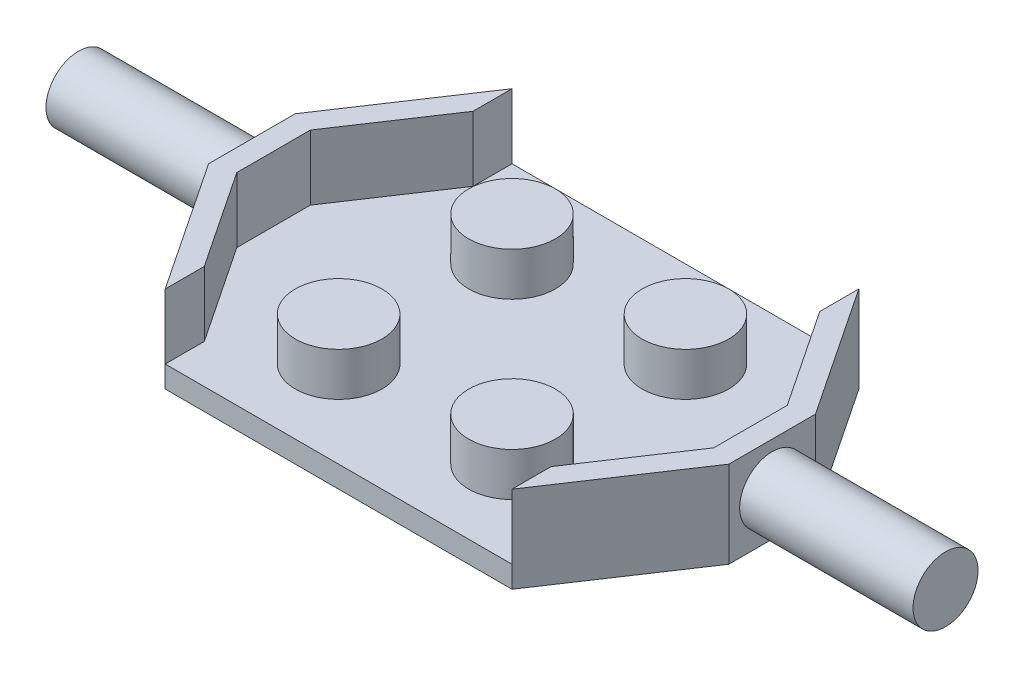
ISO-10303-21;
HEADER;
FILE_DESCRIPTION(('STEP AP214'),'2;1');
FILE_NAME('part.step','',(''),(''),'','','');
FILE_SCHEMA(('AUTOMOTIVE_DESIGN { 1 0 10303 214 1 1 1 1 }'));
ENDSEC;
DATA;
#1=APPLICATION_CONTEXT('core data for automotive mechanical design processes');
#2=APPLICATION_PROTOCOL_DEFINITION('international standard','automotive_design',2000,#1);
#3=PRODUCT_CONTEXT('',#1,'mechanical');
#4=PRODUCT('Part','Part','',(#3));
#5=PRODUCT_RELATED_PRODUCT_CATEGORY('part','',(#4));
#6=PRODUCT_DEFINITION_FORMATION('','',#4);
#7=PRODUCT_DEFINITION_CONTEXT('part definition',#1,'design');
#8=PRODUCT_DEFINITION('design','',#6,#7);
#9=PRODUCT_DEFINITION_SHAPE('','',#8);
#10=(LENGTH_UNIT() NAMED_UNIT(*) SI_UNIT(.MILLI.,.METRE.));
#11=(NAMED_UNIT(*) PLANE_ANGLE_UNIT() SI_UNIT($,.RADIAN.));
#12=(NAMED_UNIT(*) SI_UNIT($,.STERADIAN.) SOLID_ANGLE_UNIT());
#13=UNCERTAINTY_MEASURE_WITH_UNIT(LENGTH_MEASURE(1.E-05),#10,'distance_accuracy_value','');
#14=(GEOMETRIC_REPRESENTATION_CONTEXT(3) GLOBAL_UNCERTAINTY_ASSIGNED_CONTEXT((#13)) GLOBAL_UNIT_ASSIGNED_CONTEXT((#10,
#11,#12)) REPRESENTATION_CONTEXT('',''));
#15=CARTESIAN_POINT('',(0.,0.,0.));
#16=DIRECTION('',(0.,0.,1.));
#17=DIRECTION('',(1.,0.,0.));
#18=AXIS2_PLACEMENT_3D('',#15,#16,#17);
#19=CARTESIAN_POINT('',(0.,1.,0.));
#20=DIRECTION('',(0.,-1.,0.));
#21=DIRECTION('',(0.,0.,-1.));
#22=AXIS2_PLACEMENT_3D('',#19,#20,#21);
#23=PLANE('',#22);
#24=CARTESIAN_POINT('',(4.,1.,4.));
#25=DIRECTION('',(0.,-1.,0.));
#26=DIRECTION('',(0.,0.,-1.));
#27=AXIS2_PLACEMENT_3D('',#24,#25,#26);
#28=CIRCLE('',#27,2.);
#29=CARTESIAN_POINT('',(4.,1.,2.));
#30=VERTEX_POINT('',#29);
#31=EDGE_CURVE('E166',#30,#30,#28,.T.);
#32=ORIENTED_EDGE('',*,*,#31,.T.);
#33=EDGE_LOOP('',(#32));
#34=FACE_BOUND('',#33,.T.);
#35=CARTESIAN_POINT('',(4.,1.,-4.));
#36=DIRECTION('',(0.,-1.,0.));
#37=DIRECTION('',(0.,0.,1.));
#38=AXIS2_PLACEMENT_3D('',#35,#36,#37);
#39=CIRCLE('',#38,2.);
#40=CARTESIAN_POINT('',(4.,1.,-2.));
#41=VERTEX_POINT('',#40);
#42=EDGE_CURVE('E223',#41,#41,#39,.T.);
#43=ORIENTED_EDGE('',*,*,#42,.T.);
#44=EDGE_LOOP('',(#43));
#45=FACE_BOUND('',#44,.T.);
#46=CARTESIAN_POINT('',(-4.,1.,-4.));
#47=DIRECTION('',(0.,-1.,0.));
#48=DIRECTION('',(0.,0.,-1.));
#49=AXIS2_PLACEMENT_3D('',#46,#47,#48);
#50=CIRCLE('',#49,2.);
#51=CARTESIAN_POINT('',(-4.,1.,-6.));
#52=VERTEX_POINT('',#51);
#53=EDGE_CURVE('E333',#52,#52,#50,.F.);
#54=ORIENTED_EDGE('',*,*,#53,.F.);
#55=EDGE_LOOP('',(#54));
#56=FACE_BOUND('',#55,.T.);
#57=CARTESIAN_POINT('',(-4.,1.,4.));
#58=DIRECTION('',(0.,-1.,0.));
#59=DIRECTION('',(0.,0.,-1.));
#60=AXIS2_PLACEMENT_3D('',#57,#58,#59);
#61=CIRCLE('',#60,2.);
#62=CARTESIAN_POINT('',(-4.,1.,2.));
#63=VERTEX_POINT('',#62);
#64=EDGE_CURVE('E336',#63,#63,#61,.F.);
#65=ORIENTED_EDGE('',*,*,#64,.F.);
#66=EDGE_LOOP('',(#65));
#67=FACE_BOUND('',#66,.T.);
#68=DIRECTION('',(-0.554700196225229,0.,-0.832050294337844));
#69=VECTOR('',#68,1.);
#70=CARTESIAN_POINT('',(8.,1.,-6.19722436226801));
#71=LINE('',#70,#69);
#72=CARTESIAN_POINT('',(11.,1.,-1.697224362268));
#73=VERTEX_POINT('',#72);
#74=CARTESIAN_POINT('',(8.,1.,-6.19722436226801));
#75=VERTEX_POINT('',#74);
#76=EDGE_CURVE('E201',#73,#75,#71,.T.);
#77=ORIENTED_EDGE('',*,*,#76,.T.);
#78=DIRECTION('',(0.,0.,-1.));
#79=VECTOR('',#78,1.);
#80=CARTESIAN_POINT('',(8.,1.,-6.19722436226801));
#81=LINE('',#80,#79);
#82=CARTESIAN_POINT('',(8.,1.,-8.));
#83=VERTEX_POINT('',#82);
#84=EDGE_CURVE('E161',#75,#83,#81,.T.);
#85=ORIENTED_EDGE('',*,*,#84,.T.);
#86=DIRECTION('',(-1.,0.,0.));
#87=VECTOR('',#86,1.);
#88=CARTESIAN_POINT('',(0.,1.,-8.));
#89=LINE('',#88,#87);
#90=CARTESIAN_POINT('',(-8.,1.,-8.));
#91=VERTEX_POINT('',#90);
#92=EDGE_CURVE('E307',#83,#91,#89,.T.);
#93=ORIENTED_EDGE('',*,*,#92,.T.);
#94=DIRECTION('',(0.,0.,-1.));
#95=VECTOR('',#94,1.);
#96=CARTESIAN_POINT('',(-8.,1.,-6.19722436226801));
#97=LINE('',#96,#95);
#98=CARTESIAN_POINT('',(-8.,1.,-6.19722436226801));
#99=VERTEX_POINT('',#98);
#100=EDGE_CURVE('E253',#99,#91,#97,.T.);
#101=ORIENTED_EDGE('',*,*,#100,.F.);
#102=DIRECTION('',(0.554700196225229,0.,-0.832050294337844));
#103=VECTOR('',#102,1.);
#104=CARTESIAN_POINT('',(-8.,1.,-6.19722436226801));
#105=LINE('',#104,#103);
#106=CARTESIAN_POINT('',(-11.,1.,-1.697224362268));
#107=VERTEX_POINT('',#106);
#108=EDGE_CURVE('E258',#107,#99,#105,.T.);
#109=ORIENTED_EDGE('',*,*,#108,.F.);
#110=DIRECTION('',(0.,0.,-1.));
#111=VECTOR('',#110,1.);
#112=CARTESIAN_POINT('',(-11.,1.,-1.697224362268));
#113=LINE('',#112,#111);
#114=CARTESIAN_POINT('',(-11.,1.,1.69722436226801));
#115=VERTEX_POINT('',#114);
#116=EDGE_CURVE('E52',#115,#107,#113,.T.);
#117=ORIENTED_EDGE('',*,*,#116,.F.);
#118=DIRECTION('',(-0.554700196225229,0.,-0.832050294337844));
#119=VECTOR('',#118,1.);
#120=CARTESIAN_POINT('',(-11.,1.,1.69722436226801));
#121=LINE('',#120,#119);
#122=CARTESIAN_POINT('',(-8.,1.,6.19722436226801));
#123=VERTEX_POINT('',#122);
#124=EDGE_CURVE('E47',#123,#115,#121,.T.);
#125=ORIENTED_EDGE('',*,*,#124,.F.);
#126=DIRECTION('',(0.,0.,-1.));
#127=VECTOR('',#126,1.);
#128=CARTESIAN_POINT('',(-8.,1.,8.));
#129=LINE('',#128,#127);
#130=CARTESIAN_POINT('',(-8.,1.,8.));
#131=VERTEX_POINT('',#130);
#132=EDGE_CURVE('E277',#131,#123,#129,.T.);
#133=ORIENTED_EDGE('',*,*,#132,.F.);
#134=DIRECTION('',(1.,0.,0.));
#135=VECTOR('',#134,1.);
#136=CARTESIAN_POINT('',(0.,1.,8.));
#137=LINE('',#136,#135);
#138=CARTESIAN_POINT('',(8.,1.,8.));
#139=VERTEX_POINT('',#138);
#140=EDGE_CURVE('E309',#131,#139,#137,.T.);
#141=ORIENTED_EDGE('',*,*,#140,.T.);
#142=DIRECTION('',(0.,0.,-1.));
#143=VECTOR('',#142,1.);
#144=CARTESIAN_POINT('',(8.,1.,8.));
#145=LINE('',#144,#143);
#146=CARTESIAN_POINT('',(8.,1.,6.19722436226801));
#147=VERTEX_POINT('',#146);
#148=EDGE_CURVE('E178',#139,#147,#145,.T.);
#149=ORIENTED_EDGE('',*,*,#148,.T.);
#150=DIRECTION('',(0.554700196225229,0.,-0.832050294337844));
#151=VECTOR('',#150,1.);
#152=CARTESIAN_POINT('',(11.,1.,1.69722436226801));
#153=LINE('',#152,#151);
#154=CARTESIAN_POINT('',(11.,1.,1.69722436226801));
#155=VERTEX_POINT('',#154);
#156=EDGE_CURVE('E207',#147,#155,#153,.T.);
#157=ORIENTED_EDGE('',*,*,#156,.T.);
#158=DIRECTION('',(0.,0.,-1.));
#159=VECTOR('',#158,1.);
#160=CARTESIAN_POINT('',(11.,1.,-1.697224362268));
#161=LINE('',#160,#159);
#162=EDGE_CURVE('E204',#155,#73,#161,.T.);
#163=ORIENTED_EDGE('',*,*,#162,.T.);
#164=EDGE_LOOP('',(#77,#85,#93,#101,#109,#117,#125,#133,#141,#149,#157,#163));
#165=FACE_BOUND('',#164,.T.);
#166=ADVANCED_FACE('F32',(#34,#45,#56,#67,#165),#23,.F.);
#167=CARTESIAN_POINT('',(0.,1.,-8.));
#168=DIRECTION('',(0.,0.,1.));
#169=DIRECTION('',(1.,0.,0.));
#170=AXIS2_PLACEMENT_3D('',#167,#168,#169);
#171=PLANE('',#170);
#172=DIRECTION('',(-1.,0.,0.));
#173=VECTOR('',#172,1.);
#174=CARTESIAN_POINT('',(0.,0.,-8.));
#175=LINE('',#174,#173);
#176=CARTESIAN_POINT('',(8.,0.,-8.));
#177=VERTEX_POINT('',#176);
#178=CARTESIAN_POINT('',(-8.,0.,-8.));
#179=VERTEX_POINT('',#178);
#180=EDGE_CURVE('E306',#177,#179,#175,.T.);
#181=ORIENTED_EDGE('',*,*,#180,.T.);
#182=DIRECTION('',(0.,-1.,0.));
#183=VECTOR('',#182,1.);
#184=CARTESIAN_POINT('',(-8.,1.,-8.));
#185=LINE('',#184,#183);
#186=EDGE_CURVE('E330',#91,#179,#185,.T.);
#187=ORIENTED_EDGE('',*,*,#186,.F.);
#188=ORIENTED_EDGE('',*,*,#92,.F.);
#189=DIRECTION('',(0.,-1.,0.));
#190=VECTOR('',#189,1.);
#191=CARTESIAN_POINT('',(8.,1.,-8.));
#192=LINE('',#191,#190);
#193=EDGE_CURVE('E240',#83,#177,#192,.T.);
#194=ORIENTED_EDGE('',*,*,#193,.T.);
#195=EDGE_LOOP('',(#181,#187,#188,#194));
#196=FACE_BOUND('',#195,.T.);
#197=ADVANCED_FACE('F34',(#196),#171,.F.);
#198=CARTESIAN_POINT('',(-12.,1.,-2.));
#199=DIRECTION('',(0.832050294337844,0.,0.554700196225229));
#200=DIRECTION('',(0.554700196225229,0.,-0.832050294337844));
#201=AXIS2_PLACEMENT_3D('',#198,#199,#200);
#202=PLANE('',#201);
#203=DIRECTION('',(-0.554700196225229,0.,0.832050294337844));
#204=VECTOR('',#203,1.);
#205=CARTESIAN_POINT('',(-12.,0.,-2.));
#206=LINE('',#205,#204);
#207=CARTESIAN_POINT('',(-12.,0.,-2.));
#208=VERTEX_POINT('',#207);
#209=EDGE_CURVE('E315',#179,#208,#206,.T.);
#210=ORIENTED_EDGE('',*,*,#209,.T.);
#211=DIRECTION('',(0.,-1.,0.));
#212=VECTOR('',#211,1.);
#213=CARTESIAN_POINT('',(-12.,1.,-2.));
#214=LINE('',#213,#212);
#215=CARTESIAN_POINT('',(-12.,4.,-2.));
#216=VERTEX_POINT('',#215);
#217=EDGE_CURVE('E327',#216,#208,#214,.T.);
#218=ORIENTED_EDGE('',*,*,#217,.F.);
#219=DIRECTION('',(-0.554700196225229,0.,0.832050294337844));
#220=VECTOR('',#219,1.);
#221=CARTESIAN_POINT('',(-8.,4.,-8.));
#222=LINE('',#221,#220);
#223=CARTESIAN_POINT('',(-8.,4.,-8.));
#224=VERTEX_POINT('',#223);
#225=EDGE_CURVE('E257',#224,#216,#222,.T.);
#226=ORIENTED_EDGE('',*,*,#225,.F.);
#227=DIRECTION('',(0.,-1.,0.));
#228=VECTOR('',#227,1.);
#229=CARTESIAN_POINT('',(-8.,4.,-8.));
#230=LINE('',#229,#228);
#231=EDGE_CURVE('E297',#224,#91,#230,.T.);
#232=ORIENTED_EDGE('',*,*,#231,.T.);
#233=ORIENTED_EDGE('',*,*,#186,.T.);
#234=EDGE_LOOP('',(#210,#218,#226,#232,#233));
#235=FACE_BOUND('',#234,.T.);
#236=ADVANCED_FACE('F347',(#235),#202,.F.);
#237=CARTESIAN_POINT('',(-12.,1.,2.));
#238=DIRECTION('',(1.,0.,0.));
#239=DIRECTION('',(0.,0.,-1.));
#240=AXIS2_PLACEMENT_3D('',#237,#238,#239);
#241=PLANE('',#240);
#242=CARTESIAN_POINT('',(-12.,2.,0.));
#243=DIRECTION('',(1.,0.,0.));
#244=DIRECTION('',(0.,0.,-1.));
#245=AXIS2_PLACEMENT_3D('',#242,#243,#244);
#246=CIRCLE('',#245,1.5);
#247=CARTESIAN_POINT('',(-12.,2.,-1.5));
#248=VERTEX_POINT('',#247);
#249=EDGE_CURVE('E40',#248,#248,#246,.F.);
#250=ORIENTED_EDGE('',*,*,#249,.F.);
#251=EDGE_LOOP('',(#250));
#252=FACE_BOUND('',#251,.T.);
#253=DIRECTION('',(0.,0.,1.));
#254=VECTOR('',#253,1.);
#255=CARTESIAN_POINT('',(-12.,0.,2.));
#256=LINE('',#255,#254);
#257=CARTESIAN_POINT('',(-12.,0.,2.));
#258=VERTEX_POINT('',#257);
#259=EDGE_CURVE('E317',#208,#258,#256,.T.);
#260=ORIENTED_EDGE('',*,*,#259,.T.);
#261=DIRECTION('',(0.,-1.,0.));
#262=VECTOR('',#261,1.);
#263=CARTESIAN_POINT('',(-12.,1.,2.));
#264=LINE('',#263,#262);
#265=CARTESIAN_POINT('',(-12.,4.,2.));
#266=VERTEX_POINT('',#265);
#267=EDGE_CURVE('E324',#266,#258,#264,.T.);
#268=ORIENTED_EDGE('',*,*,#267,.F.);
#269=DIRECTION('',(0.,0.,1.));
#270=VECTOR('',#269,1.);
#271=CARTESIAN_POINT('',(-12.,4.,-2.));
#272=LINE('',#271,#270);
#273=EDGE_CURVE('E261',#216,#266,#272,.T.);
#274=ORIENTED_EDGE('',*,*,#273,.F.);
#275=ORIENTED_EDGE('',*,*,#217,.T.);
#276=EDGE_LOOP('',(#260,#268,#274,#275));
#277=FACE_BOUND('',#276,.T.);
#278=ADVANCED_FACE('F343',(#252,#277),#241,.F.);
#279=CARTESIAN_POINT('',(-12.,1.,2.));
#280=DIRECTION('',(0.832050294337844,0.,-0.554700196225229));
#281=DIRECTION('',(-0.554700196225229,0.,-0.832050294337844));
#282=AXIS2_PLACEMENT_3D('',#279,#280,#281);
#283=PLANE('',#282);
#284=DIRECTION('',(0.554700196225229,0.,0.832050294337844));
#285=VECTOR('',#284,1.);
#286=CARTESIAN_POINT('',(-12.,0.,2.));
#287=LINE('',#286,#285);
#288=CARTESIAN_POINT('',(-8.,0.,8.));
#289=VERTEX_POINT('',#288);
#290=EDGE_CURVE('E319',#258,#289,#287,.T.);
#291=ORIENTED_EDGE('',*,*,#290,.T.);
#292=DIRECTION('',(0.,-1.,0.));
#293=VECTOR('',#292,1.);
#294=CARTESIAN_POINT('',(-8.,1.,8.));
#295=LINE('',#294,#293);
#296=EDGE_CURVE('E313',#131,#289,#295,.T.);
#297=ORIENTED_EDGE('',*,*,#296,.F.);
#298=DIRECTION('',(0.,-1.,0.));
#299=VECTOR('',#298,1.);
#300=CARTESIAN_POINT('',(-8.,4.,8.));
#301=LINE('',#300,#299);
#302=CARTESIAN_POINT('',(-8.,4.,8.));
#303=VERTEX_POINT('',#302);
#304=EDGE_CURVE('E294',#303,#131,#301,.T.);
#305=ORIENTED_EDGE('',*,*,#304,.F.);
#306=DIRECTION('',(0.554700196225229,0.,0.832050294337844));
#307=VECTOR('',#306,1.);
#308=CARTESIAN_POINT('',(-12.,4.,2.));
#309=LINE('',#308,#307);
#310=EDGE_CURVE('E264',#266,#303,#309,.T.);
#311=ORIENTED_EDGE('',*,*,#310,.F.);
#312=ORIENTED_EDGE('',*,*,#267,.T.);
#313=EDGE_LOOP('',(#291,#297,#305,#311,#312));
#314=FACE_BOUND('',#313,.T.);
#315=ADVANCED_FACE('F346',(#314),#283,.F.);
#316=CARTESIAN_POINT('',(0.,1.,8.));
#317=DIRECTION('',(0.,0.,-1.));
#318=DIRECTION('',(-1.,0.,0.));
#319=AXIS2_PLACEMENT_3D('',#316,#317,#318);
#320=PLANE('',#319);
#321=DIRECTION('',(1.,0.,0.));
#322=VECTOR('',#321,1.);
#323=CARTESIAN_POINT('',(0.,0.,8.));
#324=LINE('',#323,#322);
#325=CARTESIAN_POINT('',(8.,0.,8.));
#326=VERTEX_POINT('',#325);
#327=EDGE_CURVE('E310',#289,#326,#324,.T.);
#328=ORIENTED_EDGE('',*,*,#327,.T.);
#329=DIRECTION('',(0.,-1.,0.));
#330=VECTOR('',#329,1.);
#331=CARTESIAN_POINT('',(8.,1.,8.));
#332=LINE('',#331,#330);
#333=EDGE_CURVE('E247',#139,#326,#332,.T.);
#334=ORIENTED_EDGE('',*,*,#333,.F.);
#335=ORIENTED_EDGE('',*,*,#140,.F.);
#336=ORIENTED_EDGE('',*,*,#296,.T.);
#337=EDGE_LOOP('',(#328,#334,#335,#336));
#338=FACE_BOUND('',#337,.T.);
#339=ADVANCED_FACE('F363',(#338),#320,.F.);
#340=CARTESIAN_POINT('',(0.,0.,0.));
#341=DIRECTION('',(0.,-1.,0.));
#342=DIRECTION('',(0.,0.,-1.));
#343=AXIS2_PLACEMENT_3D('',#340,#341,#342);
#344=PLANE('',#343);
#345=ORIENTED_EDGE('',*,*,#180,.F.);
#346=DIRECTION('',(0.554700196225229,0.,0.832050294337844));
#347=VECTOR('',#346,1.);
#348=CARTESIAN_POINT('',(12.,0.,-2.));
#349=LINE('',#348,#347);
#350=CARTESIAN_POINT('',(12.,0.,-2.));
#351=VERTEX_POINT('',#350);
#352=EDGE_CURVE('E237',#177,#351,#349,.T.);
#353=ORIENTED_EDGE('',*,*,#352,.T.);
#354=DIRECTION('',(0.,0.,1.));
#355=VECTOR('',#354,1.);
#356=CARTESIAN_POINT('',(12.,0.,2.));
#357=LINE('',#356,#355);
#358=CARTESIAN_POINT('',(12.,0.,2.));
#359=VERTEX_POINT('',#358);
#360=EDGE_CURVE('E234',#351,#359,#357,.T.);
#361=ORIENTED_EDGE('',*,*,#360,.T.);
#362=DIRECTION('',(-0.554700196225229,0.,0.832050294337844));
#363=VECTOR('',#362,1.);
#364=CARTESIAN_POINT('',(12.,0.,2.));
#365=LINE('',#364,#363);
#366=EDGE_CURVE('E229',#359,#326,#365,.T.);
#367=ORIENTED_EDGE('',*,*,#366,.T.);
#368=ORIENTED_EDGE('',*,*,#327,.F.);
#369=ORIENTED_EDGE('',*,*,#290,.F.);
#370=ORIENTED_EDGE('',*,*,#259,.F.);
#371=ORIENTED_EDGE('',*,*,#209,.F.);
#372=EDGE_LOOP('',(#345,#353,#361,#367,#368,#369,#370,#371));
#373=FACE_BOUND('',#372,.T.);
#374=ADVANCED_FACE('F359',(#373),#344,.T.);
#375=CARTESIAN_POINT('',(-4.,3.,-4.));
#376=DIRECTION('',(0.,-1.,0.));
#377=DIRECTION('',(0.,0.,-1.));
#378=AXIS2_PLACEMENT_3D('',#375,#376,#377);
#379=CYLINDRICAL_SURFACE('',#378,2.);
#380=CARTESIAN_POINT('',(-4.,3.,-4.));
#381=DIRECTION('',(0.,1.,0.));
#382=DIRECTION('',(0.,0.,1.));
#383=AXIS2_PLACEMENT_3D('',#380,#381,#382);
#384=CIRCLE('',#383,2.);
#385=CARTESIAN_POINT('',(-4.,3.,-2.));
#386=VERTEX_POINT('',#385);
#387=EDGE_CURVE('E303',#386,#386,#384,.T.);
#388=ORIENTED_EDGE('',*,*,#387,.F.);
#389=EDGE_LOOP('',(#388));
#390=FACE_BOUND('',#389,.T.);
#391=ORIENTED_EDGE('',*,*,#53,.T.);
#392=EDGE_LOOP('',(#391));
#393=FACE_BOUND('',#392,.T.);
#394=ADVANCED_FACE('F417',(#390,#393),#379,.T.);
#395=CARTESIAN_POINT('',(-4.,3.,-4.));
#396=DIRECTION('',(0.,1.,0.));
#397=DIRECTION('',(0.,0.,1.));
#398=AXIS2_PLACEMENT_3D('',#395,#396,#397);
#399=PLANE('',#398);
#400=ORIENTED_EDGE('',*,*,#387,.T.);
#401=EDGE_LOOP('',(#400));
#402=FACE_BOUND('',#401,.T.);
#403=ADVANCED_FACE('F456',(#402),#399,.T.);
#404=CARTESIAN_POINT('',(-4.,3.,4.));
#405=DIRECTION('',(0.,-1.,0.));
#406=DIRECTION('',(0.,0.,-1.));
#407=AXIS2_PLACEMENT_3D('',#404,#405,#406);
#408=CYLINDRICAL_SURFACE('',#407,2.);
#409=CARTESIAN_POINT('',(-4.,3.,4.));
#410=DIRECTION('',(0.,1.,0.));
#411=DIRECTION('',(0.,0.,-1.));
#412=AXIS2_PLACEMENT_3D('',#409,#410,#411);
#413=CIRCLE('',#412,2.);
#414=CARTESIAN_POINT('',(-4.,3.,2.));
#415=VERTEX_POINT('',#414);
#416=EDGE_CURVE('E300',#415,#415,#413,.T.);
#417=ORIENTED_EDGE('',*,*,#416,.F.);
#418=EDGE_LOOP('',(#417));
#419=FACE_BOUND('',#418,.T.);
#420=ORIENTED_EDGE('',*,*,#64,.T.);
#421=EDGE_LOOP('',(#420));
#422=FACE_BOUND('',#421,.T.);
#423=ADVANCED_FACE('F463',(#419,#422),#408,.T.);
#424=CARTESIAN_POINT('',(-4.,3.,4.));
#425=DIRECTION('',(0.,-1.,0.));
#426=DIRECTION('',(0.,0.,-1.));
#427=AXIS2_PLACEMENT_3D('',#424,#425,#426);
#428=PLANE('',#427);
#429=ORIENTED_EDGE('',*,*,#416,.T.);
#430=EDGE_LOOP('',(#429));
#431=FACE_BOUND('',#430,.T.);
#432=ADVANCED_FACE('F470',(#431),#428,.F.);
#433=CARTESIAN_POINT('',(-8.,4.,-6.19722436226801));
#434=DIRECTION('',(-1.,0.,0.));
#435=DIRECTION('',(0.,0.,1.));
#436=AXIS2_PLACEMENT_3D('',#433,#434,#435);
#437=PLANE('',#436);
#438=ORIENTED_EDGE('',*,*,#100,.T.);
#439=ORIENTED_EDGE('',*,*,#231,.F.);
#440=DIRECTION('',(0.,0.,-1.));
#441=VECTOR('',#440,1.);
#442=CARTESIAN_POINT('',(-8.,4.,-6.19722436226801));
#443=LINE('',#442,#441);
#444=CARTESIAN_POINT('',(-8.,4.,-6.19722436226801));
#445=VERTEX_POINT('',#444);
#446=EDGE_CURVE('E254',#445,#224,#443,.T.);
#447=ORIENTED_EDGE('',*,*,#446,.F.);
#448=DIRECTION('',(0.,-1.,0.));
#449=VECTOR('',#448,1.);
#450=CARTESIAN_POINT('',(-8.,4.,-6.19722436226801));
#451=LINE('',#450,#449);
#452=EDGE_CURVE('E274',#445,#99,#451,.T.);
#453=ORIENTED_EDGE('',*,*,#452,.T.);
#454=EDGE_LOOP('',(#438,#439,#447,#453));
#455=FACE_BOUND('',#454,.T.);
#456=ADVANCED_FACE('F477',(#455),#437,.F.);
#457=CARTESIAN_POINT('',(-8.,4.,8.));
#458=DIRECTION('',(-1.,0.,0.));
#459=DIRECTION('',(0.,0.,1.));
#460=AXIS2_PLACEMENT_3D('',#457,#458,#459);
#461=PLANE('',#460);
#462=ORIENTED_EDGE('',*,*,#132,.T.);
#463=DIRECTION('',(0.,-1.,0.));
#464=VECTOR('',#463,1.);
#465=CARTESIAN_POINT('',(-8.,4.,6.19722436226801));
#466=LINE('',#465,#464);
#467=CARTESIAN_POINT('',(-8.,4.,6.19722436226801));
#468=VERTEX_POINT('',#467);
#469=EDGE_CURVE('E291',#468,#123,#466,.T.);
#470=ORIENTED_EDGE('',*,*,#469,.F.);
#471=DIRECTION('',(0.,0.,-1.));
#472=VECTOR('',#471,1.);
#473=CARTESIAN_POINT('',(-8.,4.,8.));
#474=LINE('',#473,#472);
#475=EDGE_CURVE('E266',#303,#468,#474,.T.);
#476=ORIENTED_EDGE('',*,*,#475,.F.);
#477=ORIENTED_EDGE('',*,*,#304,.T.);
#478=EDGE_LOOP('',(#462,#470,#476,#477));
#479=FACE_BOUND('',#478,.T.);
#480=ADVANCED_FACE('F375',(#479),#461,.F.);
#481=CARTESIAN_POINT('',(-11.,4.,1.69722436226801));
#482=DIRECTION('',(-0.832050294337844,0.,0.554700196225229));
#483=DIRECTION('',(0.554700196225229,0.,0.832050294337844));
#484=AXIS2_PLACEMENT_3D('',#481,#482,#483);
#485=PLANE('',#484);
#486=ORIENTED_EDGE('',*,*,#124,.T.);
#487=DIRECTION('',(0.,-1.,0.));
#488=VECTOR('',#487,1.);
#489=CARTESIAN_POINT('',(-11.,4.,1.69722436226801));
#490=LINE('',#489,#488);
#491=CARTESIAN_POINT('',(-11.,4.,1.69722436226801));
#492=VERTEX_POINT('',#491);
#493=EDGE_CURVE('E288',#492,#115,#490,.T.);
#494=ORIENTED_EDGE('',*,*,#493,.F.);
#495=DIRECTION('',(-0.554700196225229,0.,-0.832050294337844));
#496=VECTOR('',#495,1.);
#497=CARTESIAN_POINT('',(-11.,4.,1.69722436226801));
#498=LINE('',#497,#496);
#499=EDGE_CURVE('E268',#468,#492,#498,.T.);
#500=ORIENTED_EDGE('',*,*,#499,.F.);
#501=ORIENTED_EDGE('',*,*,#469,.T.);
#502=EDGE_LOOP('',(#486,#494,#500,#501));
#503=FACE_BOUND('',#502,.T.);
#504=ADVANCED_FACE('F491',(#503),#485,.F.);
#505=CARTESIAN_POINT('',(-11.,4.,-1.697224362268));
#506=DIRECTION('',(-1.,0.,0.));
#507=DIRECTION('',(0.,0.,1.));
#508=AXIS2_PLACEMENT_3D('',#505,#506,#507);
#509=PLANE('',#508);
#510=ORIENTED_EDGE('',*,*,#116,.T.);
#511=DIRECTION('',(0.,-1.,0.));
#512=VECTOR('',#511,1.);
#513=CARTESIAN_POINT('',(-11.,4.,-1.697224362268));
#514=LINE('',#513,#512);
#515=CARTESIAN_POINT('',(-11.,4.,-1.697224362268));
#516=VERTEX_POINT('',#515);
#517=EDGE_CURVE('E285',#516,#107,#514,.T.);
#518=ORIENTED_EDGE('',*,*,#517,.F.);
#519=DIRECTION('',(0.,0.,-1.));
#520=VECTOR('',#519,1.);
#521=CARTESIAN_POINT('',(-11.,4.,-1.697224362268));
#522=LINE('',#521,#520);
#523=EDGE_CURVE('E270',#492,#516,#522,.T.);
#524=ORIENTED_EDGE('',*,*,#523,.F.);
#525=ORIENTED_EDGE('',*,*,#493,.T.);
#526=EDGE_LOOP('',(#510,#518,#524,#525));
#527=FACE_BOUND('',#526,.T.);
#528=ADVANCED_FACE('F498',(#527),#509,.F.);
#529=CARTESIAN_POINT('',(-8.,4.,-6.19722436226801));
#530=DIRECTION('',(-0.832050294337844,0.,-0.554700196225229));
#531=DIRECTION('',(-0.554700196225229,0.,0.832050294337844));
#532=AXIS2_PLACEMENT_3D('',#529,#530,#531);
#533=PLANE('',#532);
#534=ORIENTED_EDGE('',*,*,#108,.T.);
#535=ORIENTED_EDGE('',*,*,#452,.F.);
#536=DIRECTION('',(0.554700196225229,0.,-0.832050294337844));
#537=VECTOR('',#536,1.);
#538=CARTESIAN_POINT('',(-8.,4.,-6.19722436226801));
#539=LINE('',#538,#537);
#540=EDGE_CURVE('E272',#516,#445,#539,.T.);
#541=ORIENTED_EDGE('',*,*,#540,.F.);
#542=ORIENTED_EDGE('',*,*,#517,.T.);
#543=EDGE_LOOP('',(#534,#535,#541,#542));
#544=FACE_BOUND('',#543,.T.);
#545=ADVANCED_FACE('F506',(#544),#533,.F.);
#546=CARTESIAN_POINT('',(0.,4.,0.));
#547=DIRECTION('',(0.,1.,0.));
#548=DIRECTION('',(0.,0.,1.));
#549=AXIS2_PLACEMENT_3D('',#546,#547,#548);
#550=PLANE('',#549);
#551=ORIENTED_EDGE('',*,*,#446,.T.);
#552=ORIENTED_EDGE('',*,*,#225,.T.);
#553=ORIENTED_EDGE('',*,*,#273,.T.);
#554=ORIENTED_EDGE('',*,*,#310,.T.);
#555=ORIENTED_EDGE('',*,*,#475,.T.);
#556=ORIENTED_EDGE('',*,*,#499,.T.);
#557=ORIENTED_EDGE('',*,*,#523,.T.);
#558=ORIENTED_EDGE('',*,*,#540,.T.);
#559=EDGE_LOOP('',(#551,#552,#553,#554,#555,#556,#557,#558));
#560=FACE_BOUND('',#559,.T.);
#561=ADVANCED_FACE('F379',(#560),#550,.T.);
#562=CARTESIAN_POINT('',(-20.,2.,0.));
#563=DIRECTION('',(1.,0.,0.));
#564=DIRECTION('',(0.,0.,-1.));
#565=AXIS2_PLACEMENT_3D('',#562,#563,#564);
#566=CYLINDRICAL_SURFACE('',#565,1.5);
#567=CARTESIAN_POINT('',(-20.,2.,0.));
#568=DIRECTION('',(-1.,0.,0.));
#569=DIRECTION('',(0.,0.,1.));
#570=AXIS2_PLACEMENT_3D('',#567,#568,#569);
#571=CIRCLE('',#570,1.5);
#572=CARTESIAN_POINT('',(-20.,2.,1.5));
#573=VERTEX_POINT('',#572);
#574=EDGE_CURVE('E250',#573,#573,#571,.T.);
#575=ORIENTED_EDGE('',*,*,#574,.F.);
#576=EDGE_LOOP('',(#575));
#577=FACE_BOUND('',#576,.T.);
#578=ORIENTED_EDGE('',*,*,#249,.T.);
#579=EDGE_LOOP('',(#578));
#580=FACE_BOUND('',#579,.T.);
#581=ADVANCED_FACE('F341',(#577,#580),#566,.T.);
#582=CARTESIAN_POINT('',(-20.,2.,0.));
#583=DIRECTION('',(-1.,0.,0.));
#584=DIRECTION('',(0.,0.,1.));
#585=AXIS2_PLACEMENT_3D('',#582,#583,#584);
#586=PLANE('',#585);
#587=ORIENTED_EDGE('',*,*,#574,.T.);
#588=EDGE_LOOP('',(#587));
#589=FACE_BOUND('',#588,.T.);
#590=ADVANCED_FACE('F525',(#589),#586,.T.);
#591=CARTESIAN_POINT('',(12.,1.,2.));
#592=DIRECTION('',(0.832050294337844,0.,0.554700196225229));
#593=DIRECTION('',(0.554700196225229,0.,-0.832050294337844));
#594=AXIS2_PLACEMENT_3D('',#591,#592,#593);
#595=PLANE('',#594);
#596=ORIENTED_EDGE('',*,*,#366,.F.);
#597=DIRECTION('',(0.,-1.,0.));
#598=VECTOR('',#597,1.);
#599=CARTESIAN_POINT('',(12.,1.,2.));
#600=LINE('',#599,#598);
#601=CARTESIAN_POINT('',(12.,4.,2.));
#602=VERTEX_POINT('',#601);
#603=EDGE_CURVE('E245',#602,#359,#600,.T.);
#604=ORIENTED_EDGE('',*,*,#603,.F.);
#605=DIRECTION('',(-0.554700196225229,0.,0.832050294337844));
#606=VECTOR('',#605,1.);
#607=CARTESIAN_POINT('',(12.,4.,2.));
#608=LINE('',#607,#606);
#609=CARTESIAN_POINT('',(8.,4.,8.));
#610=VERTEX_POINT('',#609);
#611=EDGE_CURVE('E192',#602,#610,#608,.T.);
#612=ORIENTED_EDGE('',*,*,#611,.T.);
#613=DIRECTION('',(0.,-1.,0.));
#614=VECTOR('',#613,1.);
#615=CARTESIAN_POINT('',(8.,4.,8.));
#616=LINE('',#615,#614);
#617=EDGE_CURVE('E213',#610,#139,#616,.T.);
#618=ORIENTED_EDGE('',*,*,#617,.T.);
#619=ORIENTED_EDGE('',*,*,#333,.T.);
#620=EDGE_LOOP('',(#596,#604,#612,#618,#619));
#621=FACE_BOUND('',#620,.T.);
#622=ADVANCED_FACE('F366',(#621),#595,.T.);
#623=CARTESIAN_POINT('',(12.,1.,2.));
#624=DIRECTION('',(1.,0.,0.));
#625=DIRECTION('',(0.,0.,-1.));
#626=AXIS2_PLACEMENT_3D('',#623,#624,#625);
#627=PLANE('',#626);
#628=CARTESIAN_POINT('',(12.,2.,0.));
#629=DIRECTION('',(1.,0.,0.));
#630=DIRECTION('',(0.,0.,-1.));
#631=AXIS2_PLACEMENT_3D('',#628,#629,#630);
#632=CIRCLE('',#631,1.5);
#633=CARTESIAN_POINT('',(12.,2.,-1.5));
#634=VERTEX_POINT('',#633);
#635=EDGE_CURVE('E11',#634,#634,#632,.T.);
#636=ORIENTED_EDGE('',*,*,#635,.F.);
#637=EDGE_LOOP('',(#636));
#638=FACE_BOUND('',#637,.T.);
#639=ORIENTED_EDGE('',*,*,#360,.F.);
#640=DIRECTION('',(0.,-1.,0.));
#641=VECTOR('',#640,1.);
#642=CARTESIAN_POINT('',(12.,1.,-2.));
#643=LINE('',#642,#641);
#644=CARTESIAN_POINT('',(12.,4.,-2.));
#645=VERTEX_POINT('',#644);
#646=EDGE_CURVE('E243',#645,#351,#643,.T.);
#647=ORIENTED_EDGE('',*,*,#646,.F.);
#648=DIRECTION('',(0.,0.,1.));
#649=VECTOR('',#648,1.);
#650=CARTESIAN_POINT('',(12.,4.,-2.));
#651=LINE('',#650,#649);
#652=EDGE_CURVE('E195',#645,#602,#651,.T.);
#653=ORIENTED_EDGE('',*,*,#652,.T.);
#654=ORIENTED_EDGE('',*,*,#603,.T.);
#655=EDGE_LOOP('',(#639,#647,#653,#654));
#656=FACE_BOUND('',#655,.T.);
#657=ADVANCED_FACE('F393',(#638,#656),#627,.T.);
#658=CARTESIAN_POINT('',(12.,1.,-2.));
#659=DIRECTION('',(0.832050294337844,0.,-0.554700196225229));
#660=DIRECTION('',(-0.554700196225229,0.,-0.832050294337844));
#661=AXIS2_PLACEMENT_3D('',#658,#659,#660);
#662=PLANE('',#661);
#663=ORIENTED_EDGE('',*,*,#352,.F.);
#664=ORIENTED_EDGE('',*,*,#193,.F.);
#665=DIRECTION('',(0.,-1.,0.));
#666=VECTOR('',#665,1.);
#667=CARTESIAN_POINT('',(8.,4.,-8.));
#668=LINE('',#667,#666);
#669=CARTESIAN_POINT('',(8.,4.,-8.));
#670=VERTEX_POINT('',#669);
#671=EDGE_CURVE('E199',#670,#83,#668,.T.);
#672=ORIENTED_EDGE('',*,*,#671,.F.);
#673=DIRECTION('',(0.554700196225229,0.,0.832050294337844));
#674=VECTOR('',#673,1.);
#675=CARTESIAN_POINT('',(8.,4.,-8.));
#676=LINE('',#675,#674);
#677=EDGE_CURVE('E177',#670,#645,#676,.T.);
#678=ORIENTED_EDGE('',*,*,#677,.T.);
#679=ORIENTED_EDGE('',*,*,#646,.T.);
#680=EDGE_LOOP('',(#663,#664,#672,#678,#679));
#681=FACE_BOUND('',#680,.T.);
#682=ADVANCED_FACE('F390',(#681),#662,.T.);
#683=CARTESIAN_POINT('',(4.,3.,-4.));
#684=DIRECTION('',(0.,-1.,0.));
#685=DIRECTION('',(0.,0.,-1.));
#686=AXIS2_PLACEMENT_3D('',#683,#684,#685);
#687=CYLINDRICAL_SURFACE('',#686,2.);
#688=CARTESIAN_POINT('',(4.,3.,-4.));
#689=DIRECTION('',(0.,-1.,0.));
#690=DIRECTION('',(0.,0.,1.));
#691=AXIS2_PLACEMENT_3D('',#688,#689,#690);
#692=CIRCLE('',#691,2.);
#693=CARTESIAN_POINT('',(4.,3.,-2.));
#694=VERTEX_POINT('',#693);
#695=EDGE_CURVE('E226',#694,#694,#692,.T.);
#696=ORIENTED_EDGE('',*,*,#695,.T.);
#697=EDGE_LOOP('',(#696));
#698=FACE_BOUND('',#697,.T.);
#699=ORIENTED_EDGE('',*,*,#42,.F.);
#700=EDGE_LOOP('',(#699));
#701=FACE_BOUND('',#700,.T.);
#702=ADVANCED_FACE('F552',(#698,#701),#687,.T.);
#703=CARTESIAN_POINT('',(4.,3.,-4.));
#704=DIRECTION('',(0.,1.,0.));
#705=DIRECTION('',(0.,0.,1.));
#706=AXIS2_PLACEMENT_3D('',#703,#704,#705);
#707=PLANE('',#706);
#708=ORIENTED_EDGE('',*,*,#695,.F.);
#709=EDGE_LOOP('',(#708));
#710=FACE_BOUND('',#709,.T.);
#711=ADVANCED_FACE('F559',(#710),#707,.T.);
#712=CARTESIAN_POINT('',(4.,3.,4.));
#713=DIRECTION('',(0.,-1.,0.));
#714=DIRECTION('',(0.,0.,-1.));
#715=AXIS2_PLACEMENT_3D('',#712,#713,#714);
#716=CYLINDRICAL_SURFACE('',#715,2.);
#717=CARTESIAN_POINT('',(4.,3.,4.));
#718=DIRECTION('',(0.,-1.,0.));
#719=DIRECTION('',(0.,0.,-1.));
#720=AXIS2_PLACEMENT_3D('',#717,#718,#719);
#721=CIRCLE('',#720,2.);
#722=CARTESIAN_POINT('',(4.,3.,2.));
#723=VERTEX_POINT('',#722);
#724=EDGE_CURVE('E220',#723,#723,#721,.T.);
#725=ORIENTED_EDGE('',*,*,#724,.T.);
#726=EDGE_LOOP('',(#725));
#727=FACE_BOUND('',#726,.T.);
#728=ORIENTED_EDGE('',*,*,#31,.F.);
#729=EDGE_LOOP('',(#728));
#730=FACE_BOUND('',#729,.T.);
#731=ADVANCED_FACE('F567',(#727,#730),#716,.T.);
#732=CARTESIAN_POINT('',(4.,3.,4.));
#733=DIRECTION('',(0.,-1.,0.));
#734=DIRECTION('',(0.,0.,-1.));
#735=AXIS2_PLACEMENT_3D('',#732,#733,#734);
#736=PLANE('',#735);
#737=ORIENTED_EDGE('',*,*,#724,.F.);
#738=EDGE_LOOP('',(#737));
#739=FACE_BOUND('',#738,.T.);
#740=ADVANCED_FACE('F575',(#739),#736,.F.);
#741=CARTESIAN_POINT('',(8.,4.,-6.19722436226801));
#742=DIRECTION('',(-1.,0.,0.));
#743=DIRECTION('',(0.,0.,1.));
#744=AXIS2_PLACEMENT_3D('',#741,#742,#743);
#745=PLANE('',#744);
#746=ORIENTED_EDGE('',*,*,#84,.F.);
#747=DIRECTION('',(0.,-1.,0.));
#748=VECTOR('',#747,1.);
#749=CARTESIAN_POINT('',(8.,4.,-6.19722436226801));
#750=LINE('',#749,#748);
#751=CARTESIAN_POINT('',(8.,4.,-6.19722436226801));
#752=VERTEX_POINT('',#751);
#753=EDGE_CURVE('E155',#752,#75,#750,.T.);
#754=ORIENTED_EDGE('',*,*,#753,.F.);
#755=DIRECTION('',(0.,0.,-1.));
#756=VECTOR('',#755,1.);
#757=CARTESIAN_POINT('',(8.,4.,-6.19722436226801));
#758=LINE('',#757,#756);
#759=EDGE_CURVE('E158',#752,#670,#758,.T.);
#760=ORIENTED_EDGE('',*,*,#759,.T.);
#761=ORIENTED_EDGE('',*,*,#671,.T.);
#762=EDGE_LOOP('',(#746,#754,#760,#761));
#763=FACE_BOUND('',#762,.T.);
#764=ADVANCED_FACE('F157',(#763),#745,.T.);
#765=CARTESIAN_POINT('',(8.,4.,-6.19722436226801));
#766=DIRECTION('',(-0.832050294337844,0.,0.554700196225229));
#767=DIRECTION('',(0.554700196225229,0.,0.832050294337844));
#768=AXIS2_PLACEMENT_3D('',#765,#766,#767);
#769=PLANE('',#768);
#770=ORIENTED_EDGE('',*,*,#76,.F.);
#771=DIRECTION('',(0.,-1.,0.));
#772=VECTOR('',#771,1.);
#773=CARTESIAN_POINT('',(11.,4.,-1.697224362268));
#774=LINE('',#773,#772);
#775=CARTESIAN_POINT('',(11.,4.,-1.697224362268));
#776=VERTEX_POINT('',#775);
#777=EDGE_CURVE('E167',#776,#73,#774,.T.);
#778=ORIENTED_EDGE('',*,*,#777,.F.);
#779=DIRECTION('',(-0.554700196225229,0.,-0.832050294337844));
#780=VECTOR('',#779,1.);
#781=CARTESIAN_POINT('',(8.,4.,-6.19722436226801));
#782=LINE('',#781,#780);
#783=EDGE_CURVE('E173',#776,#752,#782,.T.);
#784=ORIENTED_EDGE('',*,*,#783,.T.);
#785=ORIENTED_EDGE('',*,*,#753,.T.);
#786=EDGE_LOOP('',(#770,#778,#784,#785));
#787=FACE_BOUND('',#786,.T.);
#788=ADVANCED_FACE('F180',(#787),#769,.T.);
#789=CARTESIAN_POINT('',(11.,4.,-1.697224362268));
#790=DIRECTION('',(-1.,0.,0.));
#791=DIRECTION('',(0.,0.,1.));
#792=AXIS2_PLACEMENT_3D('',#789,#790,#791);
#793=PLANE('',#792);
#794=ORIENTED_EDGE('',*,*,#162,.F.);
#795=DIRECTION('',(0.,-1.,0.));
#796=VECTOR('',#795,1.);
#797=CARTESIAN_POINT('',(11.,4.,1.69722436226801));
#798=LINE('',#797,#796);
#799=CARTESIAN_POINT('',(11.,4.,1.69722436226801));
#800=VERTEX_POINT('',#799);
#801=EDGE_CURVE('E217',#800,#155,#798,.T.);
#802=ORIENTED_EDGE('',*,*,#801,.F.);
#803=DIRECTION('',(0.,0.,-1.));
#804=VECTOR('',#803,1.);
#805=CARTESIAN_POINT('',(11.,4.,-1.697224362268));
#806=LINE('',#805,#804);
#807=EDGE_CURVE('E181',#800,#776,#806,.T.);
#808=ORIENTED_EDGE('',*,*,#807,.T.);
#809=ORIENTED_EDGE('',*,*,#777,.T.);
#810=EDGE_LOOP('',(#794,#802,#808,#809));
#811=FACE_BOUND('',#810,.T.);
#812=ADVANCED_FACE('F399',(#811),#793,.T.);
#813=CARTESIAN_POINT('',(11.,4.,1.69722436226801));
#814=DIRECTION('',(-0.832050294337844,0.,-0.554700196225229));
#815=DIRECTION('',(-0.554700196225229,0.,0.832050294337844));
#816=AXIS2_PLACEMENT_3D('',#813,#814,#815);
#817=PLANE('',#816);
#818=ORIENTED_EDGE('',*,*,#156,.F.);
#819=DIRECTION('',(0.,-1.,0.));
#820=VECTOR('',#819,1.);
#821=CARTESIAN_POINT('',(8.,4.,6.19722436226801));
#822=LINE('',#821,#820);
#823=CARTESIAN_POINT('',(8.,4.,6.19722436226801));
#824=VERTEX_POINT('',#823);
#825=EDGE_CURVE('E215',#824,#147,#822,.T.);
#826=ORIENTED_EDGE('',*,*,#825,.F.);
#827=DIRECTION('',(0.554700196225229,0.,-0.832050294337844));
#828=VECTOR('',#827,1.);
#829=CARTESIAN_POINT('',(11.,4.,1.69722436226801));
#830=LINE('',#829,#828);
#831=EDGE_CURVE('E183',#824,#800,#830,.T.);
#832=ORIENTED_EDGE('',*,*,#831,.T.);
#833=ORIENTED_EDGE('',*,*,#801,.T.);
#834=EDGE_LOOP('',(#818,#826,#832,#833));
#835=FACE_BOUND('',#834,.T.);
#836=ADVANCED_FACE('F396',(#835),#817,.T.);
#837=CARTESIAN_POINT('',(8.,4.,8.));
#838=DIRECTION('',(-1.,0.,0.));
#839=DIRECTION('',(0.,0.,1.));
#840=AXIS2_PLACEMENT_3D('',#837,#838,#839);
#841=PLANE('',#840);
#842=ORIENTED_EDGE('',*,*,#148,.F.);
#843=ORIENTED_EDGE('',*,*,#617,.F.);
#844=DIRECTION('',(0.,0.,-1.));
#845=VECTOR('',#844,1.);
#846=CARTESIAN_POINT('',(8.,4.,8.));
#847=LINE('',#846,#845);
#848=EDGE_CURVE('E189',#610,#824,#847,.T.);
#849=ORIENTED_EDGE('',*,*,#848,.T.);
#850=ORIENTED_EDGE('',*,*,#825,.T.);
#851=EDGE_LOOP('',(#842,#843,#849,#850));
#852=FACE_BOUND('',#851,.T.);
#853=ADVANCED_FACE('F371',(#852),#841,.T.);
#854=CARTESIAN_POINT('',(0.,4.,0.));
#855=DIRECTION('',(0.,1.,0.));
#856=DIRECTION('',(0.,0.,1.));
#857=AXIS2_PLACEMENT_3D('',#854,#855,#856);
#858=PLANE('',#857);
#859=ORIENTED_EDGE('',*,*,#759,.F.);
#860=ORIENTED_EDGE('',*,*,#783,.F.);
#861=ORIENTED_EDGE('',*,*,#807,.F.);
#862=ORIENTED_EDGE('',*,*,#831,.F.);
#863=ORIENTED_EDGE('',*,*,#848,.F.);
#864=ORIENTED_EDGE('',*,*,#611,.F.);
#865=ORIENTED_EDGE('',*,*,#652,.F.);
#866=ORIENTED_EDGE('',*,*,#677,.F.);
#867=EDGE_LOOP('',(#859,#860,#861,#862,#863,#864,#865,#866));
#868=FACE_BOUND('',#867,.T.);
#869=ADVANCED_FACE('F171',(#868),#858,.T.);
#870=CARTESIAN_POINT('',(20.,2.,0.));
#871=DIRECTION('',(-1.,0.,0.));
#872=DIRECTION('',(0.,0.,1.));
#873=AXIS2_PLACEMENT_3D('',#870,#871,#872);
#874=CYLINDRICAL_SURFACE('',#873,1.5);
#875=CARTESIAN_POINT('',(20.,2.,0.));
#876=DIRECTION('',(-1.,0.,0.));
#877=DIRECTION('',(0.,0.,1.));
#878=AXIS2_PLACEMENT_3D('',#875,#876,#877);
#879=CIRCLE('',#878,1.5);
#880=CARTESIAN_POINT('',(20.,2.,1.5));
#881=VERTEX_POINT('',#880);
#882=EDGE_CURVE('E202',#881,#881,#879,.T.);
#883=ORIENTED_EDGE('',*,*,#882,.T.);
#884=EDGE_LOOP('',(#883));
#885=FACE_BOUND('',#884,.T.);
#886=ORIENTED_EDGE('',*,*,#635,.T.);
#887=EDGE_LOOP('',(#886));
#888=FACE_BOUND('',#887,.T.);
#889=ADVANCED_FACE('F621',(#885,#888),#874,.T.);
#890=CARTESIAN_POINT('',(20.,2.,0.));
#891=DIRECTION('',(1.,0.,0.));
#892=DIRECTION('',(0.,0.,1.));
#893=AXIS2_PLACEMENT_3D('',#890,#891,#892);
#894=PLANE('',#893);
#895=ORIENTED_EDGE('',*,*,#882,.F.);
#896=EDGE_LOOP('',(#895));
#897=FACE_BOUND('',#896,.T.);
#898=ADVANCED_FACE('F630',(#897),#894,.T.);
#899=CLOSED_SHELL('',(#166,#197,#236,#278,#315,#339,#374,#394,#403,#423,#432,#456,#480,#504,
#528,#545,#561,#581,#590,#622,#657,#682,#702,#711,#731,#740,#764,#788,#812,#836,#853,#869,#889,#898));
#900=MANIFOLD_SOLID_BREP('B2',#899);
#901=ADVANCED_BREP_SHAPE_REPRESENTATION('',(#18,#900),#14);
#902=SHAPE_DEFINITION_REPRESENTATION(#9,#901);
ENDSEC;
END-ISO-10303-21;
